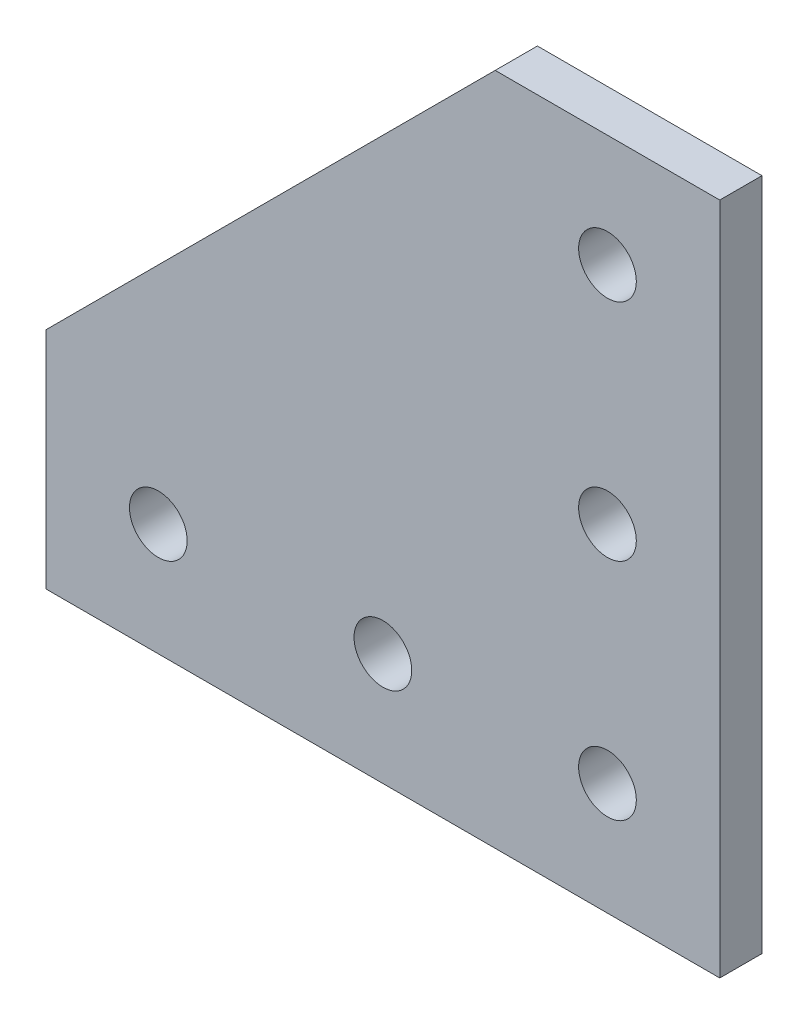
ISO-10303-21;
HEADER;
FILE_DESCRIPTION(('STEP AP214'),'2;1');
FILE_NAME('part.step','',(''),(''),'','','');
FILE_SCHEMA(('AUTOMOTIVE_DESIGN { 1 0 10303 214 1 1 1 1 }'));
ENDSEC;
DATA;
#1=APPLICATION_CONTEXT('core data for automotive mechanical design processes');
#2=APPLICATION_PROTOCOL_DEFINITION('international standard','automotive_design',2000,#1);
#3=PRODUCT_CONTEXT('',#1,'mechanical');
#4=PRODUCT('Part','Part','',(#3));
#5=PRODUCT_RELATED_PRODUCT_CATEGORY('part','',(#4));
#6=PRODUCT_DEFINITION_FORMATION('','',#4);
#7=PRODUCT_DEFINITION_CONTEXT('part definition',#1,'design');
#8=PRODUCT_DEFINITION('design','',#6,#7);
#9=PRODUCT_DEFINITION_SHAPE('','',#8);
#10=(LENGTH_UNIT() NAMED_UNIT(*) SI_UNIT(.MILLI.,.METRE.));
#11=(NAMED_UNIT(*) PLANE_ANGLE_UNIT() SI_UNIT($,.RADIAN.));
#12=(NAMED_UNIT(*) SI_UNIT($,.STERADIAN.) SOLID_ANGLE_UNIT());
#13=UNCERTAINTY_MEASURE_WITH_UNIT(LENGTH_MEASURE(1.E-05),#10,'distance_accuracy_value','');
#14=(GEOMETRIC_REPRESENTATION_CONTEXT(3) GLOBAL_UNCERTAINTY_ASSIGNED_CONTEXT((#13)) GLOBAL_UNIT_ASSIGNED_CONTEXT((#10,
#11,#12)) REPRESENTATION_CONTEXT('',''));
#15=CARTESIAN_POINT('',(0.,0.,0.));
#16=DIRECTION('',(0.,0.,1.));
#17=DIRECTION('',(1.,0.,0.));
#18=AXIS2_PLACEMENT_3D('',#15,#16,#17);
#19=CARTESIAN_POINT('',(0.,0.,4.7752));
#20=DIRECTION('',(0.,0.,1.));
#21=DIRECTION('',(1.,0.,0.));
#22=AXIS2_PLACEMENT_3D('',#19,#20,#21);
#23=PLANE('',#22);
#24=CARTESIAN_POINT('',(-25.4,0.,4.7752));
#25=DIRECTION('',(0.,0.,1.));
#26=DIRECTION('',(1.,0.,0.));
#27=AXIS2_PLACEMENT_3D('',#24,#25,#26);
#28=CIRCLE('',#27,3.2639);
#29=CARTESIAN_POINT('',(-22.1361,0.,4.7752));
#30=VERTEX_POINT('',#29);
#31=EDGE_CURVE('E177',#30,#30,#28,.T.);
#32=ORIENTED_EDGE('',*,*,#31,.F.);
#33=EDGE_LOOP('',(#32));
#34=FACE_BOUND('',#33,.T.);
#35=CARTESIAN_POINT('',(0.,25.4,4.7752));
#36=DIRECTION('',(0.,0.,1.));
#37=DIRECTION('',(1.,0.,0.));
#38=AXIS2_PLACEMENT_3D('',#35,#36,#37);
#39=CIRCLE('',#38,3.2639);
#40=CARTESIAN_POINT('',(3.2639,25.4,4.7752));
#41=VERTEX_POINT('',#40);
#42=EDGE_CURVE('E189',#41,#41,#39,.T.);
#43=ORIENTED_EDGE('',*,*,#42,.F.);
#44=EDGE_LOOP('',(#43));
#45=FACE_BOUND('',#44,.T.);
#46=DIRECTION('',(0.,-1.,0.));
#47=VECTOR('',#46,1.);
#48=CARTESIAN_POINT('',(-63.5,12.7,4.7752));
#49=LINE('',#48,#47);
#50=CARTESIAN_POINT('',(-63.5,12.7,4.7752));
#51=VERTEX_POINT('',#50);
#52=CARTESIAN_POINT('',(-63.5,-12.7,4.7752));
#53=VERTEX_POINT('',#52);
#54=EDGE_CURVE('E117',#51,#53,#49,.T.);
#55=ORIENTED_EDGE('',*,*,#54,.T.);
#56=DIRECTION('',(1.,0.,0.));
#57=VECTOR('',#56,1.);
#58=CARTESIAN_POINT('',(-63.5,-12.7,4.7752));
#59=LINE('',#58,#57);
#60=CARTESIAN_POINT('',(12.7,-12.7,4.7752));
#61=VERTEX_POINT('',#60);
#62=EDGE_CURVE('E84',#53,#61,#59,.T.);
#63=ORIENTED_EDGE('',*,*,#62,.T.);
#64=DIRECTION('',(0.,1.,0.));
#65=VECTOR('',#64,1.);
#66=CARTESIAN_POINT('',(12.7,-12.7,4.7752));
#67=LINE('',#66,#65);
#68=CARTESIAN_POINT('',(12.7,63.5,4.7752));
#69=VERTEX_POINT('',#68);
#70=EDGE_CURVE('E88',#61,#69,#67,.T.);
#71=ORIENTED_EDGE('',*,*,#70,.T.);
#72=DIRECTION('',(-1.,0.,0.));
#73=VECTOR('',#72,1.);
#74=CARTESIAN_POINT('',(12.7,63.5,4.7752));
#75=LINE('',#74,#73);
#76=CARTESIAN_POINT('',(-12.7,63.5,4.7752));
#77=VERTEX_POINT('',#76);
#78=EDGE_CURVE('E92',#69,#77,#75,.T.);
#79=ORIENTED_EDGE('',*,*,#78,.T.);
#80=DIRECTION('',(-0.707106781186548,-0.707106781186547,0.));
#81=VECTOR('',#80,1.);
#82=CARTESIAN_POINT('',(-12.7,63.5,4.7752));
#83=LINE('',#82,#81);
#84=EDGE_CURVE('E50',#77,#51,#83,.T.);
#85=ORIENTED_EDGE('',*,*,#84,.T.);
#86=EDGE_LOOP('',(#55,#63,#71,#79,#85));
#87=FACE_BOUND('',#86,.T.);
#88=CARTESIAN_POINT('',(0.,50.8,4.7752));
#89=DIRECTION('',(0.,0.,1.));
#90=DIRECTION('',(1.,0.,0.));
#91=AXIS2_PLACEMENT_3D('',#88,#89,#90);
#92=CIRCLE('',#91,3.2639);
#93=CARTESIAN_POINT('',(3.2639,50.8,4.7752));
#94=VERTEX_POINT('',#93);
#95=EDGE_CURVE('E112',#94,#94,#92,.T.);
#96=ORIENTED_EDGE('',*,*,#95,.F.);
#97=EDGE_LOOP('',(#96));
#98=FACE_BOUND('',#97,.T.);
#99=CARTESIAN_POINT('',(0.,0.,4.7752));
#100=DIRECTION('',(0.,0.,1.));
#101=DIRECTION('',(1.,0.,0.));
#102=AXIS2_PLACEMENT_3D('',#99,#100,#101);
#103=CIRCLE('',#102,3.2639);
#104=CARTESIAN_POINT('',(3.2639,0.,4.7752));
#105=VERTEX_POINT('',#104);
#106=EDGE_CURVE('E183',#105,#105,#103,.T.);
#107=ORIENTED_EDGE('',*,*,#106,.F.);
#108=EDGE_LOOP('',(#107));
#109=FACE_BOUND('',#108,.T.);
#110=CARTESIAN_POINT('',(-50.8,0.,4.7752));
#111=DIRECTION('',(0.,0.,1.));
#112=DIRECTION('',(1.,0.,0.));
#113=AXIS2_PLACEMENT_3D('',#110,#111,#112);
#114=CIRCLE('',#113,3.26389999999999);
#115=CARTESIAN_POINT('',(-47.5361,0.,4.7752));
#116=VERTEX_POINT('',#115);
#117=EDGE_CURVE('E168',#116,#116,#114,.T.);
#118=ORIENTED_EDGE('',*,*,#117,.F.);
#119=EDGE_LOOP('',(#118));
#120=FACE_BOUND('',#119,.T.);
#121=ADVANCED_FACE('F33',(#34,#45,#87,#98,#109,#120),#23,.T.);
#122=CARTESIAN_POINT('',(0.,0.,0.));
#123=DIRECTION('',(0.,0.,1.));
#124=DIRECTION('',(1.,0.,0.));
#125=AXIS2_PLACEMENT_3D('',#122,#123,#124);
#126=PLANE('',#125);
#127=CARTESIAN_POINT('',(-25.4,0.,0.));
#128=DIRECTION('',(0.,0.,1.));
#129=DIRECTION('',(1.,0.,0.));
#130=AXIS2_PLACEMENT_3D('',#127,#128,#129);
#131=CIRCLE('',#130,3.2639);
#132=CARTESIAN_POINT('',(-22.1361,0.,0.));
#133=VERTEX_POINT('',#132);
#134=EDGE_CURVE('E174',#133,#133,#131,.T.);
#135=ORIENTED_EDGE('',*,*,#134,.T.);
#136=EDGE_LOOP('',(#135));
#137=FACE_BOUND('',#136,.T.);
#138=CARTESIAN_POINT('',(0.,25.4,0.));
#139=DIRECTION('',(0.,0.,1.));
#140=DIRECTION('',(1.,0.,0.));
#141=AXIS2_PLACEMENT_3D('',#138,#139,#140);
#142=CIRCLE('',#141,3.2639);
#143=CARTESIAN_POINT('',(3.2639,25.4,0.));
#144=VERTEX_POINT('',#143);
#145=EDGE_CURVE('E186',#144,#144,#142,.T.);
#146=ORIENTED_EDGE('',*,*,#145,.T.);
#147=EDGE_LOOP('',(#146));
#148=FACE_BOUND('',#147,.T.);
#149=DIRECTION('',(0.,-1.,0.));
#150=VECTOR('',#149,1.);
#151=CARTESIAN_POINT('',(-63.5,12.7,0.));
#152=LINE('',#151,#150);
#153=CARTESIAN_POINT('',(-63.5,12.7,0.));
#154=VERTEX_POINT('',#153);
#155=CARTESIAN_POINT('',(-63.5,-12.7,0.));
#156=VERTEX_POINT('',#155);
#157=EDGE_CURVE('E108',#154,#156,#152,.T.);
#158=ORIENTED_EDGE('',*,*,#157,.F.);
#159=DIRECTION('',(-0.707106781186548,-0.707106781186547,0.));
#160=VECTOR('',#159,1.);
#161=CARTESIAN_POINT('',(-12.7,63.5,0.));
#162=LINE('',#161,#160);
#163=CARTESIAN_POINT('',(-12.7,63.5,0.));
#164=VERTEX_POINT('',#163);
#165=EDGE_CURVE('E76',#164,#154,#162,.T.);
#166=ORIENTED_EDGE('',*,*,#165,.F.);
#167=DIRECTION('',(-1.,0.,0.));
#168=VECTOR('',#167,1.);
#169=CARTESIAN_POINT('',(12.7,63.5,0.));
#170=LINE('',#169,#168);
#171=CARTESIAN_POINT('',(12.7,63.5,0.));
#172=VERTEX_POINT('',#171);
#173=EDGE_CURVE('E70',#172,#164,#170,.T.);
#174=ORIENTED_EDGE('',*,*,#173,.F.);
#175=DIRECTION('',(0.,1.,0.));
#176=VECTOR('',#175,1.);
#177=CARTESIAN_POINT('',(12.7,-12.7,0.));
#178=LINE('',#177,#176);
#179=CARTESIAN_POINT('',(12.7,-12.7,0.));
#180=VERTEX_POINT('',#179);
#181=EDGE_CURVE('E99',#180,#172,#178,.T.);
#182=ORIENTED_EDGE('',*,*,#181,.F.);
#183=DIRECTION('',(1.,0.,0.));
#184=VECTOR('',#183,1.);
#185=CARTESIAN_POINT('',(-63.5,-12.7,0.));
#186=LINE('',#185,#184);
#187=EDGE_CURVE('E111',#156,#180,#186,.T.);
#188=ORIENTED_EDGE('',*,*,#187,.F.);
#189=EDGE_LOOP('',(#158,#166,#174,#182,#188));
#190=FACE_BOUND('',#189,.T.);
#191=CARTESIAN_POINT('',(0.,50.8,0.));
#192=DIRECTION('',(0.,0.,1.));
#193=DIRECTION('',(1.,0.,0.));
#194=AXIS2_PLACEMENT_3D('',#191,#192,#193);
#195=CIRCLE('',#194,3.2639);
#196=CARTESIAN_POINT('',(3.2639,50.8,0.));
#197=VERTEX_POINT('',#196);
#198=EDGE_CURVE('E192',#197,#197,#195,.T.);
#199=ORIENTED_EDGE('',*,*,#198,.T.);
#200=EDGE_LOOP('',(#199));
#201=FACE_BOUND('',#200,.T.);
#202=CARTESIAN_POINT('',(0.,0.,0.));
#203=DIRECTION('',(0.,0.,1.));
#204=DIRECTION('',(1.,0.,0.));
#205=AXIS2_PLACEMENT_3D('',#202,#203,#204);
#206=CIRCLE('',#205,3.2639);
#207=CARTESIAN_POINT('',(3.2639,0.,0.));
#208=VERTEX_POINT('',#207);
#209=EDGE_CURVE('E180',#208,#208,#206,.T.);
#210=ORIENTED_EDGE('',*,*,#209,.T.);
#211=EDGE_LOOP('',(#210));
#212=FACE_BOUND('',#211,.T.);
#213=CARTESIAN_POINT('',(-50.8,0.,0.));
#214=DIRECTION('',(0.,0.,1.));
#215=DIRECTION('',(1.,0.,0.));
#216=AXIS2_PLACEMENT_3D('',#213,#214,#215);
#217=CIRCLE('',#216,3.26389999999999);
#218=CARTESIAN_POINT('',(-47.5361,0.,0.));
#219=VERTEX_POINT('',#218);
#220=EDGE_CURVE('E171',#219,#219,#217,.T.);
#221=ORIENTED_EDGE('',*,*,#220,.T.);
#222=EDGE_LOOP('',(#221));
#223=FACE_BOUND('',#222,.T.);
#224=ADVANCED_FACE('F121',(#137,#148,#190,#201,#212,#223),#126,.F.);
#225=CARTESIAN_POINT('',(-63.5,12.7,4.7752));
#226=DIRECTION('',(1.,0.,0.));
#227=DIRECTION('',(0.,0.,-1.));
#228=AXIS2_PLACEMENT_3D('',#225,#226,#227);
#229=PLANE('',#228);
#230=ORIENTED_EDGE('',*,*,#157,.T.);
#231=DIRECTION('',(0.,0.,-1.));
#232=VECTOR('',#231,1.);
#233=CARTESIAN_POINT('',(-63.5,-12.7,4.7752));
#234=LINE('',#233,#232);
#235=EDGE_CURVE('E11',#53,#156,#234,.T.);
#236=ORIENTED_EDGE('',*,*,#235,.F.);
#237=ORIENTED_EDGE('',*,*,#54,.F.);
#238=DIRECTION('',(0.,0.,-1.));
#239=VECTOR('',#238,1.);
#240=CARTESIAN_POINT('',(-63.5,12.7,4.7752));
#241=LINE('',#240,#239);
#242=EDGE_CURVE('E104',#51,#154,#241,.T.);
#243=ORIENTED_EDGE('',*,*,#242,.T.);
#244=EDGE_LOOP('',(#230,#236,#237,#243));
#245=FACE_BOUND('',#244,.T.);
#246=ADVANCED_FACE('F35',(#245),#229,.F.);
#247=CARTESIAN_POINT('',(-63.5,-12.7,4.7752));
#248=DIRECTION('',(0.,1.,0.));
#249=DIRECTION('',(0.,0.,1.));
#250=AXIS2_PLACEMENT_3D('',#247,#248,#249);
#251=PLANE('',#250);
#252=ORIENTED_EDGE('',*,*,#187,.T.);
#253=DIRECTION('',(0.,0.,-1.));
#254=VECTOR('',#253,1.);
#255=CARTESIAN_POINT('',(12.7,-12.7,4.7752));
#256=LINE('',#255,#254);
#257=EDGE_CURVE('E42',#61,#180,#256,.T.);
#258=ORIENTED_EDGE('',*,*,#257,.F.);
#259=ORIENTED_EDGE('',*,*,#62,.F.);
#260=ORIENTED_EDGE('',*,*,#235,.T.);
#261=EDGE_LOOP('',(#252,#258,#259,#260));
#262=FACE_BOUND('',#261,.T.);
#263=ADVANCED_FACE('F249',(#262),#251,.F.);
#264=CARTESIAN_POINT('',(12.7,-12.7,4.7752));
#265=DIRECTION('',(-1.,0.,0.));
#266=DIRECTION('',(0.,0.,1.));
#267=AXIS2_PLACEMENT_3D('',#264,#265,#266);
#268=PLANE('',#267);
#269=ORIENTED_EDGE('',*,*,#181,.T.);
#270=DIRECTION('',(0.,0.,-1.));
#271=VECTOR('',#270,1.);
#272=CARTESIAN_POINT('',(12.7,63.5,4.7752));
#273=LINE('',#272,#271);
#274=EDGE_CURVE('E96',#69,#172,#273,.T.);
#275=ORIENTED_EDGE('',*,*,#274,.F.);
#276=ORIENTED_EDGE('',*,*,#70,.F.);
#277=ORIENTED_EDGE('',*,*,#257,.T.);
#278=EDGE_LOOP('',(#269,#275,#276,#277));
#279=FACE_BOUND('',#278,.T.);
#280=ADVANCED_FACE('F97',(#279),#268,.F.);
#281=CARTESIAN_POINT('',(12.7,63.5,4.7752));
#282=DIRECTION('',(0.,-1.,0.));
#283=DIRECTION('',(0.,0.,-1.));
#284=AXIS2_PLACEMENT_3D('',#281,#282,#283);
#285=PLANE('',#284);
#286=ORIENTED_EDGE('',*,*,#173,.T.);
#287=DIRECTION('',(0.,0.,-1.));
#288=VECTOR('',#287,1.);
#289=CARTESIAN_POINT('',(-12.7,63.5,4.7752));
#290=LINE('',#289,#288);
#291=EDGE_CURVE('E100',#77,#164,#290,.T.);
#292=ORIENTED_EDGE('',*,*,#291,.F.);
#293=ORIENTED_EDGE('',*,*,#78,.F.);
#294=ORIENTED_EDGE('',*,*,#274,.T.);
#295=EDGE_LOOP('',(#286,#292,#293,#294));
#296=FACE_BOUND('',#295,.T.);
#297=ADVANCED_FACE('F102',(#296),#285,.F.);
#298=CARTESIAN_POINT('',(-12.7,63.5,4.7752));
#299=DIRECTION('',(0.707106781186547,-0.707106781186548,0.));
#300=DIRECTION('',(0.707106781186548,0.707106781186547,0.));
#301=AXIS2_PLACEMENT_3D('',#298,#299,#300);
#302=PLANE('',#301);
#303=ORIENTED_EDGE('',*,*,#165,.T.);
#304=ORIENTED_EDGE('',*,*,#242,.F.);
#305=ORIENTED_EDGE('',*,*,#84,.F.);
#306=ORIENTED_EDGE('',*,*,#291,.T.);
#307=EDGE_LOOP('',(#303,#304,#305,#306));
#308=FACE_BOUND('',#307,.T.);
#309=ADVANCED_FACE('F126',(#308),#302,.F.);
#310=CARTESIAN_POINT('',(0.,50.8,4.7752));
#311=DIRECTION('',(0.,0.,-1.));
#312=DIRECTION('',(-1.,0.,0.));
#313=AXIS2_PLACEMENT_3D('',#310,#311,#312);
#314=CYLINDRICAL_SURFACE('',#313,3.2639);
#315=ORIENTED_EDGE('',*,*,#95,.T.);
#316=EDGE_LOOP('',(#315));
#317=FACE_BOUND('',#316,.T.);
#318=ORIENTED_EDGE('',*,*,#198,.F.);
#319=EDGE_LOOP('',(#318));
#320=FACE_BOUND('',#319,.T.);
#321=ADVANCED_FACE('F128',(#317,#320),#314,.F.);
#322=CARTESIAN_POINT('',(0.,25.4,4.7752));
#323=DIRECTION('',(0.,0.,-1.));
#324=DIRECTION('',(-1.,0.,0.));
#325=AXIS2_PLACEMENT_3D('',#322,#323,#324);
#326=CYLINDRICAL_SURFACE('',#325,3.2639);
#327=ORIENTED_EDGE('',*,*,#42,.T.);
#328=EDGE_LOOP('',(#327));
#329=FACE_BOUND('',#328,.T.);
#330=ORIENTED_EDGE('',*,*,#145,.F.);
#331=EDGE_LOOP('',(#330));
#332=FACE_BOUND('',#331,.T.);
#333=ADVANCED_FACE('F134',(#329,#332),#326,.F.);
#334=CARTESIAN_POINT('',(0.,0.,4.7752));
#335=DIRECTION('',(0.,0.,-1.));
#336=DIRECTION('',(-1.,0.,0.));
#337=AXIS2_PLACEMENT_3D('',#334,#335,#336);
#338=CYLINDRICAL_SURFACE('',#337,3.2639);
#339=ORIENTED_EDGE('',*,*,#106,.T.);
#340=EDGE_LOOP('',(#339));
#341=FACE_BOUND('',#340,.T.);
#342=ORIENTED_EDGE('',*,*,#209,.F.);
#343=EDGE_LOOP('',(#342));
#344=FACE_BOUND('',#343,.T.);
#345=ADVANCED_FACE('F151',(#341,#344),#338,.F.);
#346=CARTESIAN_POINT('',(-25.4,0.,4.7752));
#347=DIRECTION('',(0.,0.,-1.));
#348=DIRECTION('',(-1.,0.,0.));
#349=AXIS2_PLACEMENT_3D('',#346,#347,#348);
#350=CYLINDRICAL_SURFACE('',#349,3.2639);
#351=ORIENTED_EDGE('',*,*,#31,.T.);
#352=EDGE_LOOP('',(#351));
#353=FACE_BOUND('',#352,.T.);
#354=ORIENTED_EDGE('',*,*,#134,.F.);
#355=EDGE_LOOP('',(#354));
#356=FACE_BOUND('',#355,.T.);
#357=ADVANCED_FACE('F155',(#353,#356),#350,.F.);
#358=CARTESIAN_POINT('',(-50.8,0.,4.7752));
#359=DIRECTION('',(0.,0.,-1.));
#360=DIRECTION('',(-1.,0.,0.));
#361=AXIS2_PLACEMENT_3D('',#358,#359,#360);
#362=CYLINDRICAL_SURFACE('',#361,3.26389999999999);
#363=ORIENTED_EDGE('',*,*,#117,.T.);
#364=EDGE_LOOP('',(#363));
#365=FACE_BOUND('',#364,.T.);
#366=ORIENTED_EDGE('',*,*,#220,.F.);
#367=EDGE_LOOP('',(#366));
#368=FACE_BOUND('',#367,.T.);
#369=ADVANCED_FACE('F159',(#365,#368),#362,.F.);
#370=CLOSED_SHELL('',(#121,#224,#246,#263,#280,#297,#309,#321,#333,#345,#357,#369));
#371=MANIFOLD_SOLID_BREP('B2',#370);
#372=ADVANCED_BREP_SHAPE_REPRESENTATION('',(#18,#371),#14);
#373=SHAPE_DEFINITION_REPRESENTATION(#9,#372);
ENDSEC;
END-ISO-10303-21;
